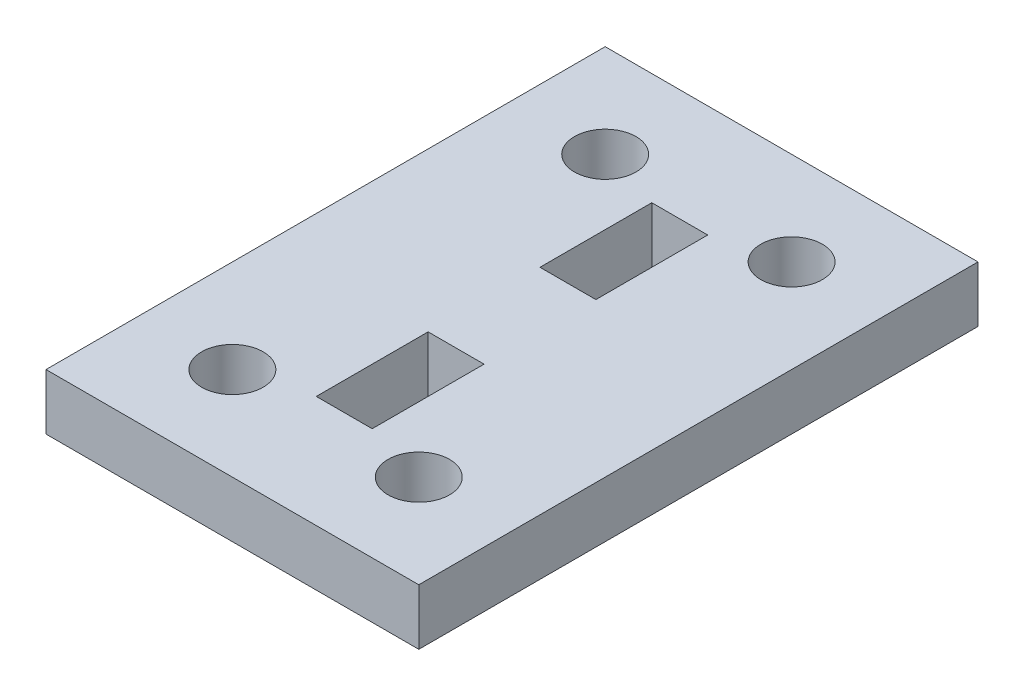
ISO-10303-21;
HEADER;
FILE_DESCRIPTION(('STEP AP214'),'2;1');
FILE_NAME('part.step','',(''),(''),'','','');
FILE_SCHEMA(('AUTOMOTIVE_DESIGN { 1 0 10303 214 1 1 1 1 }'));
ENDSEC;
DATA;
#1=APPLICATION_CONTEXT('core data for automotive mechanical design processes');
#2=APPLICATION_PROTOCOL_DEFINITION('international standard','automotive_design',2000,#1);
#3=PRODUCT_CONTEXT('',#1,'mechanical');
#4=PRODUCT('Part','Part','',(#3));
#5=PRODUCT_RELATED_PRODUCT_CATEGORY('part','',(#4));
#6=PRODUCT_DEFINITION_FORMATION('','',#4);
#7=PRODUCT_DEFINITION_CONTEXT('part definition',#1,'design');
#8=PRODUCT_DEFINITION('design','',#6,#7);
#9=PRODUCT_DEFINITION_SHAPE('','',#8);
#10=(LENGTH_UNIT() NAMED_UNIT(*) SI_UNIT(.MILLI.,.METRE.));
#11=(NAMED_UNIT(*) PLANE_ANGLE_UNIT() SI_UNIT($,.RADIAN.));
#12=(NAMED_UNIT(*) SI_UNIT($,.STERADIAN.) SOLID_ANGLE_UNIT());
#13=UNCERTAINTY_MEASURE_WITH_UNIT(LENGTH_MEASURE(1.E-05),#10,'distance_accuracy_value','');
#14=(GEOMETRIC_REPRESENTATION_CONTEXT(3) GLOBAL_UNCERTAINTY_ASSIGNED_CONTEXT((#13)) GLOBAL_UNIT_ASSIGNED_CONTEXT((#10,
#11,#12)) REPRESENTATION_CONTEXT('',''));
#15=CARTESIAN_POINT('',(0.,0.,0.));
#16=DIRECTION('',(0.,0.,1.));
#17=DIRECTION('',(1.,0.,0.));
#18=AXIS2_PLACEMENT_3D('',#15,#16,#17);
#19=CARTESIAN_POINT('',(0.,3.,0.));
#20=DIRECTION('',(0.,1.,0.));
#21=DIRECTION('',(0.,0.,1.));
#22=AXIS2_PLACEMENT_3D('',#19,#20,#21);
#23=PLANE('',#22);
#24=CARTESIAN_POINT('',(5.,3.,-10.));
#25=DIRECTION('',(0.,1.,0.));
#26=DIRECTION('',(0.,0.,1.));
#27=AXIS2_PLACEMENT_3D('',#24,#25,#26);
#28=CIRCLE('',#27,1.65);
#29=CARTESIAN_POINT('',(5.,3.,-8.35));
#30=VERTEX_POINT('',#29);
#31=EDGE_CURVE('E164',#30,#30,#28,.T.);
#32=ORIENTED_EDGE('',*,*,#31,.F.);
#33=EDGE_LOOP('',(#32));
#34=FACE_BOUND('',#33,.T.);
#35=CARTESIAN_POINT('',(-4.99999999999999,3.,10.));
#36=DIRECTION('',(0.,1.,0.));
#37=DIRECTION('',(0.,0.,1.));
#38=AXIS2_PLACEMENT_3D('',#35,#36,#37);
#39=CIRCLE('',#38,1.65);
#40=CARTESIAN_POINT('',(-4.99999999999999,3.,11.65));
#41=VERTEX_POINT('',#40);
#42=EDGE_CURVE('E207',#41,#41,#39,.T.);
#43=ORIENTED_EDGE('',*,*,#42,.F.);
#44=EDGE_LOOP('',(#43));
#45=FACE_BOUND('',#44,.T.);
#46=DIRECTION('',(0.,0.,1.));
#47=VECTOR('',#46,1.);
#48=CARTESIAN_POINT('',(-9.99999999999999,3.,15.));
#49=LINE('',#48,#47);
#50=CARTESIAN_POINT('',(-9.99999999999999,3.,-15.));
#51=VERTEX_POINT('',#50);
#52=CARTESIAN_POINT('',(-9.99999999999999,3.,15.));
#53=VERTEX_POINT('',#52);
#54=EDGE_CURVE('E213',#51,#53,#49,.T.);
#55=ORIENTED_EDGE('',*,*,#54,.T.);
#56=DIRECTION('',(1.,0.,0.));
#57=VECTOR('',#56,1.);
#58=CARTESIAN_POINT('',(10.,3.,15.));
#59=LINE('',#58,#57);
#60=CARTESIAN_POINT('',(10.,3.,15.));
#61=VERTEX_POINT('',#60);
#62=EDGE_CURVE('E216',#53,#61,#59,.T.);
#63=ORIENTED_EDGE('',*,*,#62,.T.);
#64=DIRECTION('',(0.,0.,-1.));
#65=VECTOR('',#64,1.);
#66=CARTESIAN_POINT('',(10.,3.,15.));
#67=LINE('',#66,#65);
#68=CARTESIAN_POINT('',(10.,3.,-15.));
#69=VERTEX_POINT('',#68);
#70=EDGE_CURVE('E219',#61,#69,#67,.T.);
#71=ORIENTED_EDGE('',*,*,#70,.T.);
#72=DIRECTION('',(-1.,0.,0.));
#73=VECTOR('',#72,1.);
#74=CARTESIAN_POINT('',(10.,3.,-15.));
#75=LINE('',#74,#73);
#76=EDGE_CURVE('E221',#69,#51,#75,.T.);
#77=ORIENTED_EDGE('',*,*,#76,.T.);
#78=EDGE_LOOP('',(#55,#63,#71,#77));
#79=FACE_BOUND('',#78,.T.);
#80=CARTESIAN_POINT('',(5.,3.,10.));
#81=DIRECTION('',(0.,1.,0.));
#82=DIRECTION('',(0.,0.,-1.));
#83=AXIS2_PLACEMENT_3D('',#80,#81,#82);
#84=CIRCLE('',#83,1.65);
#85=CARTESIAN_POINT('',(5.,3.,8.35));
#86=VERTEX_POINT('',#85);
#87=EDGE_CURVE('E201',#86,#86,#84,.T.);
#88=ORIENTED_EDGE('',*,*,#87,.F.);
#89=EDGE_LOOP('',(#88));
#90=FACE_BOUND('',#89,.T.);
#91=DIRECTION('',(1.,0.,0.));
#92=VECTOR('',#91,1.);
#93=CARTESIAN_POINT('',(-1.5,3.,9.));
#94=LINE('',#93,#92);
#95=CARTESIAN_POINT('',(-1.5,3.,9.));
#96=VERTEX_POINT('',#95);
#97=CARTESIAN_POINT('',(1.5,3.,9.));
#98=VERTEX_POINT('',#97);
#99=EDGE_CURVE('E172',#96,#98,#94,.T.);
#100=ORIENTED_EDGE('',*,*,#99,.F.);
#101=DIRECTION('',(0.,0.,1.));
#102=VECTOR('',#101,1.);
#103=CARTESIAN_POINT('',(-1.5,3.,9.));
#104=LINE('',#103,#102);
#105=CARTESIAN_POINT('',(-1.5,3.,3.));
#106=VERTEX_POINT('',#105);
#107=EDGE_CURVE('E170',#106,#96,#104,.T.);
#108=ORIENTED_EDGE('',*,*,#107,.F.);
#109=DIRECTION('',(-1.,0.,0.));
#110=VECTOR('',#109,1.);
#111=CARTESIAN_POINT('',(-1.5,3.,3.));
#112=LINE('',#111,#110);
#113=CARTESIAN_POINT('',(1.5,3.,3.));
#114=VERTEX_POINT('',#113);
#115=EDGE_CURVE('E178',#114,#106,#112,.T.);
#116=ORIENTED_EDGE('',*,*,#115,.F.);
#117=DIRECTION('',(0.,0.,-1.));
#118=VECTOR('',#117,1.);
#119=CARTESIAN_POINT('',(1.5,3.,9.));
#120=LINE('',#119,#118);
#121=EDGE_CURVE('E175',#98,#114,#120,.T.);
#122=ORIENTED_EDGE('',*,*,#121,.F.);
#123=EDGE_LOOP('',(#100,#108,#116,#122));
#124=FACE_BOUND('',#123,.T.);
#125=CARTESIAN_POINT('',(-5.,3.,-10.));
#126=DIRECTION('',(0.,1.,0.));
#127=DIRECTION('',(0.,0.,-1.));
#128=AXIS2_PLACEMENT_3D('',#125,#126,#127);
#129=CIRCLE('',#128,1.65);
#130=CARTESIAN_POINT('',(-5.,3.,-11.65));
#131=VERTEX_POINT('',#130);
#132=EDGE_CURVE('E158',#131,#131,#129,.T.);
#133=ORIENTED_EDGE('',*,*,#132,.F.);
#134=EDGE_LOOP('',(#133));
#135=FACE_BOUND('',#134,.T.);
#136=DIRECTION('',(0.,0.,1.));
#137=VECTOR('',#136,1.);
#138=CARTESIAN_POINT('',(-1.5,3.,-9.));
#139=LINE('',#138,#137);
#140=CARTESIAN_POINT('',(-1.5,3.,-9.));
#141=VERTEX_POINT('',#140);
#142=CARTESIAN_POINT('',(-1.5,3.,-3.));
#143=VERTEX_POINT('',#142);
#144=EDGE_CURVE('E130',#141,#143,#139,.T.);
#145=ORIENTED_EDGE('',*,*,#144,.F.);
#146=DIRECTION('',(-1.,0.,0.));
#147=VECTOR('',#146,1.);
#148=CARTESIAN_POINT('',(-1.5,3.,-9.));
#149=LINE('',#148,#147);
#150=CARTESIAN_POINT('',(1.5,3.,-9.));
#151=VERTEX_POINT('',#150);
#152=EDGE_CURVE('E122',#151,#141,#149,.T.);
#153=ORIENTED_EDGE('',*,*,#152,.F.);
#154=DIRECTION('',(0.,0.,-1.));
#155=VECTOR('',#154,1.);
#156=CARTESIAN_POINT('',(1.5,3.,-9.));
#157=LINE('',#156,#155);
#158=CARTESIAN_POINT('',(1.5,3.,-3.));
#159=VERTEX_POINT('',#158);
#160=EDGE_CURVE('E144',#159,#151,#157,.T.);
#161=ORIENTED_EDGE('',*,*,#160,.F.);
#162=DIRECTION('',(1.,0.,0.));
#163=VECTOR('',#162,1.);
#164=CARTESIAN_POINT('',(-1.5,3.,-3.));
#165=LINE('',#164,#163);
#166=EDGE_CURVE('E142',#143,#159,#165,.T.);
#167=ORIENTED_EDGE('',*,*,#166,.F.);
#168=EDGE_LOOP('',(#145,#153,#161,#167));
#169=FACE_BOUND('',#168,.T.);
#170=ADVANCED_FACE('F33',(#34,#45,#79,#90,#124,#135,#169),#23,.T.);
#171=CARTESIAN_POINT('',(0.,0.,0.));
#172=DIRECTION('',(0.,1.,0.));
#173=DIRECTION('',(0.,0.,1.));
#174=AXIS2_PLACEMENT_3D('',#171,#172,#173);
#175=PLANE('',#174);
#176=CARTESIAN_POINT('',(-5.,0.,-10.));
#177=DIRECTION('',(0.,1.,0.));
#178=DIRECTION('',(0.,0.,-1.));
#179=AXIS2_PLACEMENT_3D('',#176,#177,#178);
#180=CIRCLE('',#179,1.65);
#181=CARTESIAN_POINT('',(-5.,0.,-11.65));
#182=VERTEX_POINT('',#181);
#183=EDGE_CURVE('E138',#182,#182,#180,.T.);
#184=ORIENTED_EDGE('',*,*,#183,.T.);
#185=EDGE_LOOP('',(#184));
#186=FACE_BOUND('',#185,.T.);
#187=CARTESIAN_POINT('',(5.,0.,-10.));
#188=DIRECTION('',(0.,1.,0.));
#189=DIRECTION('',(0.,0.,1.));
#190=AXIS2_PLACEMENT_3D('',#187,#188,#189);
#191=CIRCLE('',#190,1.65);
#192=CARTESIAN_POINT('',(5.,0.,-8.35));
#193=VERTEX_POINT('',#192);
#194=EDGE_CURVE('E161',#193,#193,#191,.T.);
#195=ORIENTED_EDGE('',*,*,#194,.T.);
#196=EDGE_LOOP('',(#195));
#197=FACE_BOUND('',#196,.T.);
#198=DIRECTION('',(0.,0.,1.));
#199=VECTOR('',#198,1.);
#200=CARTESIAN_POINT('',(-1.5,0.,9.));
#201=LINE('',#200,#199);
#202=CARTESIAN_POINT('',(-1.5,0.,3.));
#203=VERTEX_POINT('',#202);
#204=CARTESIAN_POINT('',(-1.5,0.,9.));
#205=VERTEX_POINT('',#204);
#206=EDGE_CURVE('E167',#203,#205,#201,.T.);
#207=ORIENTED_EDGE('',*,*,#206,.T.);
#208=DIRECTION('',(1.,0.,0.));
#209=VECTOR('',#208,1.);
#210=CARTESIAN_POINT('',(-1.5,0.,9.));
#211=LINE('',#210,#209);
#212=CARTESIAN_POINT('',(1.5,0.,9.));
#213=VERTEX_POINT('',#212);
#214=EDGE_CURVE('E183',#205,#213,#211,.T.);
#215=ORIENTED_EDGE('',*,*,#214,.T.);
#216=DIRECTION('',(0.,0.,-1.));
#217=VECTOR('',#216,1.);
#218=CARTESIAN_POINT('',(1.5,0.,9.));
#219=LINE('',#218,#217);
#220=CARTESIAN_POINT('',(1.5,0.,3.));
#221=VERTEX_POINT('',#220);
#222=EDGE_CURVE('E186',#213,#221,#219,.T.);
#223=ORIENTED_EDGE('',*,*,#222,.T.);
#224=DIRECTION('',(-1.,0.,0.));
#225=VECTOR('',#224,1.);
#226=CARTESIAN_POINT('',(-1.5,0.,3.));
#227=LINE('',#226,#225);
#228=EDGE_CURVE('E173',#221,#203,#227,.T.);
#229=ORIENTED_EDGE('',*,*,#228,.T.);
#230=EDGE_LOOP('',(#207,#215,#223,#229));
#231=FACE_BOUND('',#230,.T.);
#232=DIRECTION('',(0.,0.,1.));
#233=VECTOR('',#232,1.);
#234=CARTESIAN_POINT('',(-9.99999999999999,0.,15.));
#235=LINE('',#234,#233);
#236=CARTESIAN_POINT('',(-9.99999999999999,0.,-15.));
#237=VERTEX_POINT('',#236);
#238=CARTESIAN_POINT('',(-9.99999999999999,0.,15.));
#239=VERTEX_POINT('',#238);
#240=EDGE_CURVE('E210',#237,#239,#235,.T.);
#241=ORIENTED_EDGE('',*,*,#240,.F.);
#242=DIRECTION('',(-1.,0.,0.));
#243=VECTOR('',#242,1.);
#244=CARTESIAN_POINT('',(10.,0.,-15.));
#245=LINE('',#244,#243);
#246=CARTESIAN_POINT('',(10.,0.,-15.));
#247=VERTEX_POINT('',#246);
#248=EDGE_CURVE('E217',#247,#237,#245,.T.);
#249=ORIENTED_EDGE('',*,*,#248,.F.);
#250=DIRECTION('',(0.,0.,-1.));
#251=VECTOR('',#250,1.);
#252=CARTESIAN_POINT('',(10.,0.,15.));
#253=LINE('',#252,#251);
#254=CARTESIAN_POINT('',(10.,0.,15.));
#255=VERTEX_POINT('',#254);
#256=EDGE_CURVE('E228',#255,#247,#253,.T.);
#257=ORIENTED_EDGE('',*,*,#256,.F.);
#258=DIRECTION('',(1.,0.,0.));
#259=VECTOR('',#258,1.);
#260=CARTESIAN_POINT('',(10.,0.,15.));
#261=LINE('',#260,#259);
#262=EDGE_CURVE('E226',#239,#255,#261,.T.);
#263=ORIENTED_EDGE('',*,*,#262,.F.);
#264=EDGE_LOOP('',(#241,#249,#257,#263));
#265=FACE_BOUND('',#264,.T.);
#266=CARTESIAN_POINT('',(-4.99999999999999,0.,10.));
#267=DIRECTION('',(0.,1.,0.));
#268=DIRECTION('',(0.,0.,1.));
#269=AXIS2_PLACEMENT_3D('',#266,#267,#268);
#270=CIRCLE('',#269,1.65);
#271=CARTESIAN_POINT('',(-4.99999999999999,0.,11.65));
#272=VERTEX_POINT('',#271);
#273=EDGE_CURVE('E204',#272,#272,#270,.T.);
#274=ORIENTED_EDGE('',*,*,#273,.T.);
#275=EDGE_LOOP('',(#274));
#276=FACE_BOUND('',#275,.T.);
#277=CARTESIAN_POINT('',(5.,0.,10.));
#278=DIRECTION('',(0.,1.,0.));
#279=DIRECTION('',(0.,0.,-1.));
#280=AXIS2_PLACEMENT_3D('',#277,#278,#279);
#281=CIRCLE('',#280,1.65);
#282=CARTESIAN_POINT('',(5.,0.,8.35));
#283=VERTEX_POINT('',#282);
#284=EDGE_CURVE('E200',#283,#283,#281,.T.);
#285=ORIENTED_EDGE('',*,*,#284,.T.);
#286=EDGE_LOOP('',(#285));
#287=FACE_BOUND('',#286,.T.);
#288=DIRECTION('',(-1.,0.,0.));
#289=VECTOR('',#288,1.);
#290=CARTESIAN_POINT('',(-1.5,0.,-9.));
#291=LINE('',#290,#289);
#292=CARTESIAN_POINT('',(1.5,0.,-9.));
#293=VERTEX_POINT('',#292);
#294=CARTESIAN_POINT('',(-1.5,0.,-9.));
#295=VERTEX_POINT('',#294);
#296=EDGE_CURVE('E56',#293,#295,#291,.T.);
#297=ORIENTED_EDGE('',*,*,#296,.T.);
#298=DIRECTION('',(0.,0.,1.));
#299=VECTOR('',#298,1.);
#300=CARTESIAN_POINT('',(-1.5,0.,-9.));
#301=LINE('',#300,#299);
#302=CARTESIAN_POINT('',(-1.5,0.,-3.));
#303=VERTEX_POINT('',#302);
#304=EDGE_CURVE('E137',#295,#303,#301,.T.);
#305=ORIENTED_EDGE('',*,*,#304,.T.);
#306=DIRECTION('',(1.,0.,0.));
#307=VECTOR('',#306,1.);
#308=CARTESIAN_POINT('',(-1.5,0.,-3.));
#309=LINE('',#308,#307);
#310=CARTESIAN_POINT('',(1.5,0.,-3.));
#311=VERTEX_POINT('',#310);
#312=EDGE_CURVE('E150',#303,#311,#309,.T.);
#313=ORIENTED_EDGE('',*,*,#312,.T.);
#314=DIRECTION('',(0.,0.,-1.));
#315=VECTOR('',#314,1.);
#316=CARTESIAN_POINT('',(1.5,0.,-9.));
#317=LINE('',#316,#315);
#318=EDGE_CURVE('E131',#311,#293,#317,.T.);
#319=ORIENTED_EDGE('',*,*,#318,.T.);
#320=EDGE_LOOP('',(#297,#305,#313,#319));
#321=FACE_BOUND('',#320,.T.);
#322=ADVANCED_FACE('F246',(#186,#197,#231,#265,#276,#287,#321),#175,.F.);
#323=CARTESIAN_POINT('',(-9.99999999999999,3.,15.));
#324=DIRECTION('',(1.,0.,0.));
#325=DIRECTION('',(0.,0.,-1.));
#326=AXIS2_PLACEMENT_3D('',#323,#324,#325);
#327=PLANE('',#326);
#328=ORIENTED_EDGE('',*,*,#240,.T.);
#329=DIRECTION('',(0.,-1.,0.));
#330=VECTOR('',#329,1.);
#331=CARTESIAN_POINT('',(-9.99999999999999,3.,15.));
#332=LINE('',#331,#330);
#333=EDGE_CURVE('E11',#53,#239,#332,.T.);
#334=ORIENTED_EDGE('',*,*,#333,.F.);
#335=ORIENTED_EDGE('',*,*,#54,.F.);
#336=DIRECTION('',(0.,-1.,0.));
#337=VECTOR('',#336,1.);
#338=CARTESIAN_POINT('',(-9.99999999999999,3.,-15.));
#339=LINE('',#338,#337);
#340=EDGE_CURVE('E223',#51,#237,#339,.T.);
#341=ORIENTED_EDGE('',*,*,#340,.T.);
#342=EDGE_LOOP('',(#328,#334,#335,#341));
#343=FACE_BOUND('',#342,.T.);
#344=ADVANCED_FACE('F35',(#343),#327,.F.);
#345=CARTESIAN_POINT('',(10.,3.,15.));
#346=DIRECTION('',(0.,0.,-1.));
#347=DIRECTION('',(-1.,0.,0.));
#348=AXIS2_PLACEMENT_3D('',#345,#346,#347);
#349=PLANE('',#348);
#350=ORIENTED_EDGE('',*,*,#262,.T.);
#351=DIRECTION('',(0.,-1.,0.));
#352=VECTOR('',#351,1.);
#353=CARTESIAN_POINT('',(10.,3.,15.));
#354=LINE('',#353,#352);
#355=EDGE_CURVE('E41',#61,#255,#354,.T.);
#356=ORIENTED_EDGE('',*,*,#355,.F.);
#357=ORIENTED_EDGE('',*,*,#62,.F.);
#358=ORIENTED_EDGE('',*,*,#333,.T.);
#359=EDGE_LOOP('',(#350,#356,#357,#358));
#360=FACE_BOUND('',#359,.T.);
#361=ADVANCED_FACE('F257',(#360),#349,.F.);
#362=CARTESIAN_POINT('',(10.,3.,15.));
#363=DIRECTION('',(-1.,0.,0.));
#364=DIRECTION('',(0.,0.,1.));
#365=AXIS2_PLACEMENT_3D('',#362,#363,#364);
#366=PLANE('',#365);
#367=ORIENTED_EDGE('',*,*,#256,.T.);
#368=DIRECTION('',(0.,-1.,0.));
#369=VECTOR('',#368,1.);
#370=CARTESIAN_POINT('',(10.,3.,-15.));
#371=LINE('',#370,#369);
#372=EDGE_CURVE('E233',#69,#247,#371,.T.);
#373=ORIENTED_EDGE('',*,*,#372,.F.);
#374=ORIENTED_EDGE('',*,*,#70,.F.);
#375=ORIENTED_EDGE('',*,*,#355,.T.);
#376=EDGE_LOOP('',(#367,#373,#374,#375));
#377=FACE_BOUND('',#376,.T.);
#378=ADVANCED_FACE('F240',(#377),#366,.F.);
#379=CARTESIAN_POINT('',(10.,3.,-15.));
#380=DIRECTION('',(0.,0.,1.));
#381=DIRECTION('',(1.,0.,0.));
#382=AXIS2_PLACEMENT_3D('',#379,#380,#381);
#383=PLANE('',#382);
#384=ORIENTED_EDGE('',*,*,#248,.T.);
#385=ORIENTED_EDGE('',*,*,#340,.F.);
#386=ORIENTED_EDGE('',*,*,#76,.F.);
#387=ORIENTED_EDGE('',*,*,#372,.T.);
#388=EDGE_LOOP('',(#384,#385,#386,#387));
#389=FACE_BOUND('',#388,.T.);
#390=ADVANCED_FACE('F250',(#389),#383,.F.);
#391=CARTESIAN_POINT('',(-4.99999999999999,3.,10.));
#392=DIRECTION('',(0.,-1.,0.));
#393=DIRECTION('',(0.,0.,-1.));
#394=AXIS2_PLACEMENT_3D('',#391,#392,#393);
#395=CYLINDRICAL_SURFACE('',#394,1.65);
#396=ORIENTED_EDGE('',*,*,#42,.T.);
#397=EDGE_LOOP('',(#396));
#398=FACE_BOUND('',#397,.T.);
#399=ORIENTED_EDGE('',*,*,#273,.F.);
#400=EDGE_LOOP('',(#399));
#401=FACE_BOUND('',#400,.T.);
#402=ADVANCED_FACE('F275',(#398,#401),#395,.F.);
#403=CARTESIAN_POINT('',(5.,3.,10.));
#404=DIRECTION('',(0.,-1.,0.));
#405=DIRECTION('',(0.,0.,-1.));
#406=AXIS2_PLACEMENT_3D('',#403,#404,#405);
#407=CYLINDRICAL_SURFACE('',#406,1.65);
#408=ORIENTED_EDGE('',*,*,#87,.T.);
#409=EDGE_LOOP('',(#408));
#410=FACE_BOUND('',#409,.T.);
#411=ORIENTED_EDGE('',*,*,#284,.F.);
#412=EDGE_LOOP('',(#411));
#413=FACE_BOUND('',#412,.T.);
#414=ADVANCED_FACE('F282',(#410,#413),#407,.F.);
#415=CARTESIAN_POINT('',(-1.5,3.,9.));
#416=DIRECTION('',(1.,0.,0.));
#417=DIRECTION('',(0.,0.,-1.));
#418=AXIS2_PLACEMENT_3D('',#415,#416,#417);
#419=PLANE('',#418);
#420=ORIENTED_EDGE('',*,*,#206,.F.);
#421=DIRECTION('',(0.,-1.,0.));
#422=VECTOR('',#421,1.);
#423=CARTESIAN_POINT('',(-1.5,3.,3.));
#424=LINE('',#423,#422);
#425=EDGE_CURVE('E180',#106,#203,#424,.T.);
#426=ORIENTED_EDGE('',*,*,#425,.F.);
#427=ORIENTED_EDGE('',*,*,#107,.T.);
#428=DIRECTION('',(0.,-1.,0.));
#429=VECTOR('',#428,1.);
#430=CARTESIAN_POINT('',(-1.5,3.,9.));
#431=LINE('',#430,#429);
#432=EDGE_CURVE('E197',#96,#205,#431,.T.);
#433=ORIENTED_EDGE('',*,*,#432,.T.);
#434=EDGE_LOOP('',(#420,#426,#427,#433));
#435=FACE_BOUND('',#434,.T.);
#436=ADVANCED_FACE('F287',(#435),#419,.T.);
#437=CARTESIAN_POINT('',(-1.5,3.,9.));
#438=DIRECTION('',(0.,0.,-1.));
#439=DIRECTION('',(-1.,0.,0.));
#440=AXIS2_PLACEMENT_3D('',#437,#438,#439);
#441=PLANE('',#440);
#442=ORIENTED_EDGE('',*,*,#214,.F.);
#443=ORIENTED_EDGE('',*,*,#432,.F.);
#444=ORIENTED_EDGE('',*,*,#99,.T.);
#445=DIRECTION('',(0.,-1.,0.));
#446=VECTOR('',#445,1.);
#447=CARTESIAN_POINT('',(1.5,3.,9.));
#448=LINE('',#447,#446);
#449=EDGE_CURVE('E195',#98,#213,#448,.T.);
#450=ORIENTED_EDGE('',*,*,#449,.T.);
#451=EDGE_LOOP('',(#442,#443,#444,#450));
#452=FACE_BOUND('',#451,.T.);
#453=ADVANCED_FACE('F325',(#452),#441,.T.);
#454=CARTESIAN_POINT('',(1.5,3.,9.));
#455=DIRECTION('',(-1.,0.,0.));
#456=DIRECTION('',(0.,0.,1.));
#457=AXIS2_PLACEMENT_3D('',#454,#455,#456);
#458=PLANE('',#457);
#459=ORIENTED_EDGE('',*,*,#222,.F.);
#460=ORIENTED_EDGE('',*,*,#449,.F.);
#461=ORIENTED_EDGE('',*,*,#121,.T.);
#462=DIRECTION('',(0.,-1.,0.));
#463=VECTOR('',#462,1.);
#464=CARTESIAN_POINT('',(1.5,3.,3.));
#465=LINE('',#464,#463);
#466=EDGE_CURVE('E193',#114,#221,#465,.T.);
#467=ORIENTED_EDGE('',*,*,#466,.T.);
#468=EDGE_LOOP('',(#459,#460,#461,#467));
#469=FACE_BOUND('',#468,.T.);
#470=ADVANCED_FACE('F321',(#469),#458,.T.);
#471=CARTESIAN_POINT('',(-1.5,3.,3.));
#472=DIRECTION('',(0.,0.,1.));
#473=DIRECTION('',(1.,0.,0.));
#474=AXIS2_PLACEMENT_3D('',#471,#472,#473);
#475=PLANE('',#474);
#476=ORIENTED_EDGE('',*,*,#228,.F.);
#477=ORIENTED_EDGE('',*,*,#466,.F.);
#478=ORIENTED_EDGE('',*,*,#115,.T.);
#479=ORIENTED_EDGE('',*,*,#425,.T.);
#480=EDGE_LOOP('',(#476,#477,#478,#479));
#481=FACE_BOUND('',#480,.T.);
#482=ADVANCED_FACE('F317',(#481),#475,.T.);
#483=CARTESIAN_POINT('',(5.,3.,-10.));
#484=DIRECTION('',(0.,-1.,0.));
#485=DIRECTION('',(0.,0.,-1.));
#486=AXIS2_PLACEMENT_3D('',#483,#484,#485);
#487=CYLINDRICAL_SURFACE('',#486,1.65);
#488=ORIENTED_EDGE('',*,*,#31,.T.);
#489=EDGE_LOOP('',(#488));
#490=FACE_BOUND('',#489,.T.);
#491=ORIENTED_EDGE('',*,*,#194,.F.);
#492=EDGE_LOOP('',(#491));
#493=FACE_BOUND('',#492,.T.);
#494=ADVANCED_FACE('F313',(#490,#493),#487,.F.);
#495=CARTESIAN_POINT('',(-5.,3.,-10.));
#496=DIRECTION('',(0.,-1.,0.));
#497=DIRECTION('',(0.,0.,-1.));
#498=AXIS2_PLACEMENT_3D('',#495,#496,#497);
#499=CYLINDRICAL_SURFACE('',#498,1.65);
#500=ORIENTED_EDGE('',*,*,#132,.T.);
#501=EDGE_LOOP('',(#500));
#502=FACE_BOUND('',#501,.T.);
#503=ORIENTED_EDGE('',*,*,#183,.F.);
#504=EDGE_LOOP('',(#503));
#505=FACE_BOUND('',#504,.T.);
#506=ADVANCED_FACE('F310',(#502,#505),#499,.F.);
#507=CARTESIAN_POINT('',(-1.5,3.,-9.));
#508=DIRECTION('',(0.,0.,1.));
#509=DIRECTION('',(1.,0.,0.));
#510=AXIS2_PLACEMENT_3D('',#507,#508,#509);
#511=PLANE('',#510);
#512=ORIENTED_EDGE('',*,*,#296,.F.);
#513=DIRECTION('',(0.,-1.,0.));
#514=VECTOR('',#513,1.);
#515=CARTESIAN_POINT('',(1.5,3.,-9.));
#516=LINE('',#515,#514);
#517=EDGE_CURVE('E126',#151,#293,#516,.T.);
#518=ORIENTED_EDGE('',*,*,#517,.F.);
#519=ORIENTED_EDGE('',*,*,#152,.T.);
#520=DIRECTION('',(0.,-1.,0.));
#521=VECTOR('',#520,1.);
#522=CARTESIAN_POINT('',(-1.5,3.,-9.));
#523=LINE('',#522,#521);
#524=EDGE_CURVE('E125',#141,#295,#523,.T.);
#525=ORIENTED_EDGE('',*,*,#524,.T.);
#526=EDGE_LOOP('',(#512,#518,#519,#525));
#527=FACE_BOUND('',#526,.T.);
#528=ADVANCED_FACE('F124',(#527),#511,.T.);
#529=CARTESIAN_POINT('',(-1.5,3.,-9.));
#530=DIRECTION('',(1.,0.,0.));
#531=DIRECTION('',(0.,0.,-1.));
#532=AXIS2_PLACEMENT_3D('',#529,#530,#531);
#533=PLANE('',#532);
#534=ORIENTED_EDGE('',*,*,#304,.F.);
#535=ORIENTED_EDGE('',*,*,#524,.F.);
#536=ORIENTED_EDGE('',*,*,#144,.T.);
#537=DIRECTION('',(0.,-1.,0.));
#538=VECTOR('',#537,1.);
#539=CARTESIAN_POINT('',(-1.5,3.,-3.));
#540=LINE('',#539,#538);
#541=EDGE_CURVE('E139',#143,#303,#540,.T.);
#542=ORIENTED_EDGE('',*,*,#541,.T.);
#543=EDGE_LOOP('',(#534,#535,#536,#542));
#544=FACE_BOUND('',#543,.T.);
#545=ADVANCED_FACE('F134',(#544),#533,.T.);
#546=CARTESIAN_POINT('',(-1.5,3.,-3.));
#547=DIRECTION('',(0.,0.,-1.));
#548=DIRECTION('',(-1.,0.,0.));
#549=AXIS2_PLACEMENT_3D('',#546,#547,#548);
#550=PLANE('',#549);
#551=ORIENTED_EDGE('',*,*,#312,.F.);
#552=ORIENTED_EDGE('',*,*,#541,.F.);
#553=ORIENTED_EDGE('',*,*,#166,.T.);
#554=DIRECTION('',(0.,-1.,0.));
#555=VECTOR('',#554,1.);
#556=CARTESIAN_POINT('',(1.5,3.,-3.));
#557=LINE('',#556,#555);
#558=EDGE_CURVE('E48',#159,#311,#557,.T.);
#559=ORIENTED_EDGE('',*,*,#558,.T.);
#560=EDGE_LOOP('',(#551,#552,#553,#559));
#561=FACE_BOUND('',#560,.T.);
#562=ADVANCED_FACE('F298',(#561),#550,.T.);
#563=CARTESIAN_POINT('',(1.5,3.,-9.));
#564=DIRECTION('',(-1.,0.,0.));
#565=DIRECTION('',(0.,0.,1.));
#566=AXIS2_PLACEMENT_3D('',#563,#564,#565);
#567=PLANE('',#566);
#568=ORIENTED_EDGE('',*,*,#318,.F.);
#569=ORIENTED_EDGE('',*,*,#558,.F.);
#570=ORIENTED_EDGE('',*,*,#160,.T.);
#571=ORIENTED_EDGE('',*,*,#517,.T.);
#572=EDGE_LOOP('',(#568,#569,#570,#571));
#573=FACE_BOUND('',#572,.T.);
#574=ADVANCED_FACE('F296',(#573),#567,.T.);
#575=CLOSED_SHELL('',(#170,#322,#344,#361,#378,#390,#402,#414,#436,#453,#470,#482,#494,#506,
#528,#545,#562,#574));
#576=MANIFOLD_SOLID_BREP('B2',#575);
#577=ADVANCED_BREP_SHAPE_REPRESENTATION('',(#18,#576),#14);
#578=SHAPE_DEFINITION_REPRESENTATION(#9,#577);
ENDSEC;
END-ISO-10303-21;
